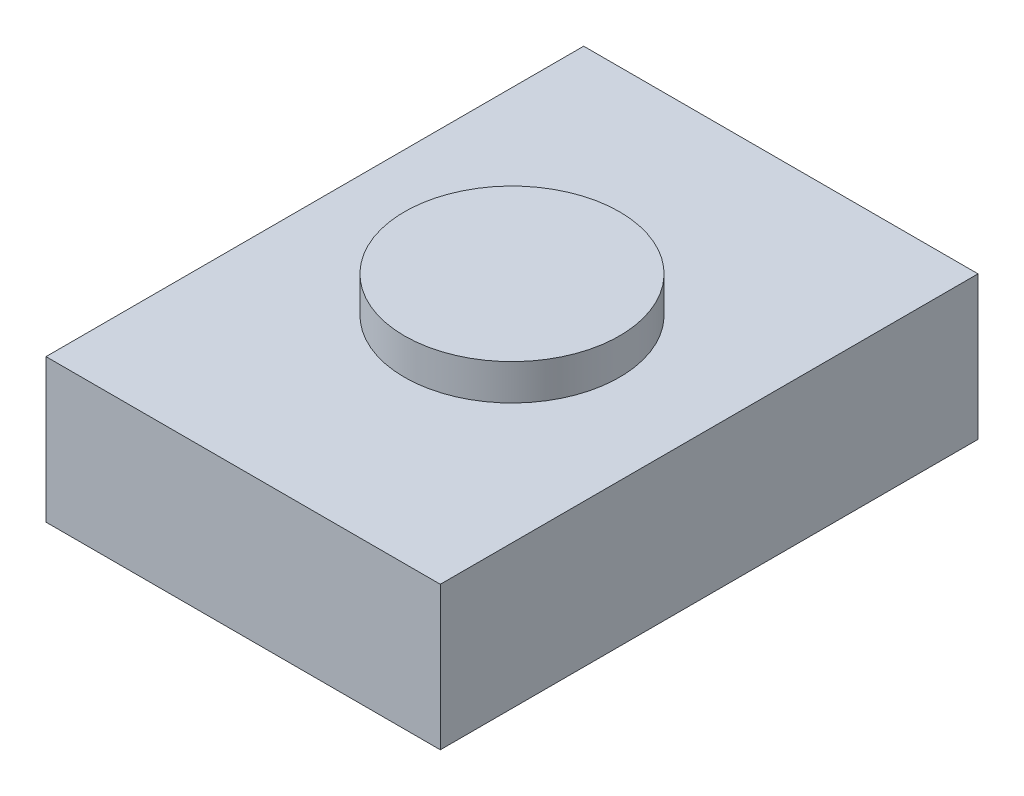
ISO-10303-21;
HEADER;
FILE_DESCRIPTION(('STEP AP214'),'2;1');
FILE_NAME('part.step','',(''),(''),'','','');
FILE_SCHEMA(('AUTOMOTIVE_DESIGN { 1 0 10303 214 1 1 1 1 }'));
ENDSEC;
DATA;
#1=APPLICATION_CONTEXT('core data for automotive mechanical design processes');
#2=APPLICATION_PROTOCOL_DEFINITION('international standard','automotive_design',2000,#1);
#3=PRODUCT_CONTEXT('',#1,'mechanical');
#4=PRODUCT('Part','Part','',(#3));
#5=PRODUCT_RELATED_PRODUCT_CATEGORY('part','',(#4));
#6=PRODUCT_DEFINITION_FORMATION('','',#4);
#7=PRODUCT_DEFINITION_CONTEXT('part definition',#1,'design');
#8=PRODUCT_DEFINITION('design','',#6,#7);
#9=PRODUCT_DEFINITION_SHAPE('','',#8);
#10=(LENGTH_UNIT() NAMED_UNIT(*) SI_UNIT(.MILLI.,.METRE.));
#11=(NAMED_UNIT(*) PLANE_ANGLE_UNIT() SI_UNIT($,.RADIAN.));
#12=(NAMED_UNIT(*) SI_UNIT($,.STERADIAN.) SOLID_ANGLE_UNIT());
#13=UNCERTAINTY_MEASURE_WITH_UNIT(LENGTH_MEASURE(1.E-05),#10,'distance_accuracy_value','');
#14=(GEOMETRIC_REPRESENTATION_CONTEXT(3) GLOBAL_UNCERTAINTY_ASSIGNED_CONTEXT((#13)) GLOBAL_UNIT_ASSIGNED_CONTEXT((#10,
#11,#12)) REPRESENTATION_CONTEXT('',''));
#15=CARTESIAN_POINT('',(0.,0.,0.));
#16=DIRECTION('',(0.,0.,1.));
#17=DIRECTION('',(1.,0.,0.));
#18=AXIS2_PLACEMENT_3D('',#15,#16,#17);
#19=CARTESIAN_POINT('',(1.397,1.016,-1.905));
#20=DIRECTION('',(-1.,0.,0.));
#21=DIRECTION('',(0.,0.,1.));
#22=AXIS2_PLACEMENT_3D('',#19,#20,#21);
#23=PLANE('',#22);
#24=DIRECTION('',(0.,0.,-1.));
#25=VECTOR('',#24,1.);
#26=CARTESIAN_POINT('',(1.397,0.,-1.905));
#27=LINE('',#26,#25);
#28=CARTESIAN_POINT('',(1.397,0.,1.905));
#29=VERTEX_POINT('',#28);
#30=CARTESIAN_POINT('',(1.397,0.,-1.905));
#31=VERTEX_POINT('',#30);
#32=EDGE_CURVE('E99',#29,#31,#27,.T.);
#33=ORIENTED_EDGE('',*,*,#32,.T.);
#34=DIRECTION('',(0.,-1.,0.));
#35=VECTOR('',#34,1.);
#36=CARTESIAN_POINT('',(1.397,1.016,-1.905));
#37=LINE('',#36,#35);
#38=CARTESIAN_POINT('',(1.397,1.016,-1.905));
#39=VERTEX_POINT('',#38);
#40=EDGE_CURVE('E36',#39,#31,#37,.T.);
#41=ORIENTED_EDGE('',*,*,#40,.F.);
#42=DIRECTION('',(0.,0.,-1.));
#43=VECTOR('',#42,1.);
#44=CARTESIAN_POINT('',(1.397,1.016,-1.905));
#45=LINE('',#44,#43);
#46=CARTESIAN_POINT('',(1.397,1.016,1.905));
#47=VERTEX_POINT('',#46);
#48=EDGE_CURVE('E86',#47,#39,#45,.T.);
#49=ORIENTED_EDGE('',*,*,#48,.F.);
#50=DIRECTION('',(0.,-1.,0.));
#51=VECTOR('',#50,1.);
#52=CARTESIAN_POINT('',(1.397,1.016,1.905));
#53=LINE('',#52,#51);
#54=EDGE_CURVE('E95',#47,#29,#53,.T.);
#55=ORIENTED_EDGE('',*,*,#54,.T.);
#56=EDGE_LOOP('',(#33,#41,#49,#55));
#57=FACE_BOUND('',#56,.T.);
#58=ADVANCED_FACE('F33',(#57),#23,.F.);
#59=CARTESIAN_POINT('',(-1.397,1.016,-1.905));
#60=DIRECTION('',(0.,0.,1.));
#61=DIRECTION('',(1.,0.,0.));
#62=AXIS2_PLACEMENT_3D('',#59,#60,#61);
#63=PLANE('',#62);
#64=DIRECTION('',(-1.,0.,0.));
#65=VECTOR('',#64,1.);
#66=CARTESIAN_POINT('',(-1.397,0.,-1.905));
#67=LINE('',#66,#65);
#68=CARTESIAN_POINT('',(-1.397,0.,-1.905));
#69=VERTEX_POINT('',#68);
#70=EDGE_CURVE('E91',#31,#69,#67,.T.);
#71=ORIENTED_EDGE('',*,*,#70,.T.);
#72=DIRECTION('',(0.,-1.,0.));
#73=VECTOR('',#72,1.);
#74=CARTESIAN_POINT('',(-1.397,1.016,-1.905));
#75=LINE('',#74,#73);
#76=CARTESIAN_POINT('',(-1.397,1.016,-1.905));
#77=VERTEX_POINT('',#76);
#78=EDGE_CURVE('E89',#77,#69,#75,.T.);
#79=ORIENTED_EDGE('',*,*,#78,.F.);
#80=DIRECTION('',(-1.,0.,0.));
#81=VECTOR('',#80,1.);
#82=CARTESIAN_POINT('',(-1.397,1.016,-1.905));
#83=LINE('',#82,#81);
#84=EDGE_CURVE('E81',#39,#77,#83,.T.);
#85=ORIENTED_EDGE('',*,*,#84,.F.);
#86=ORIENTED_EDGE('',*,*,#40,.T.);
#87=EDGE_LOOP('',(#71,#79,#85,#86));
#88=FACE_BOUND('',#87,.T.);
#89=ADVANCED_FACE('F90',(#88),#63,.F.);
#90=CARTESIAN_POINT('',(-1.397,1.016,-1.905));
#91=DIRECTION('',(1.,0.,0.));
#92=DIRECTION('',(0.,0.,-1.));
#93=AXIS2_PLACEMENT_3D('',#90,#91,#92);
#94=PLANE('',#93);
#95=DIRECTION('',(0.,0.,1.));
#96=VECTOR('',#95,1.);
#97=CARTESIAN_POINT('',(-1.397,0.,-1.905));
#98=LINE('',#97,#96);
#99=CARTESIAN_POINT('',(-1.397,0.,1.905));
#100=VERTEX_POINT('',#99);
#101=EDGE_CURVE('E67',#69,#100,#98,.T.);
#102=ORIENTED_EDGE('',*,*,#101,.T.);
#103=DIRECTION('',(0.,-1.,0.));
#104=VECTOR('',#103,1.);
#105=CARTESIAN_POINT('',(-1.397,1.016,1.905));
#106=LINE('',#105,#104);
#107=CARTESIAN_POINT('',(-1.397,1.016,1.905));
#108=VERTEX_POINT('',#107);
#109=EDGE_CURVE('E92',#108,#100,#106,.T.);
#110=ORIENTED_EDGE('',*,*,#109,.F.);
#111=DIRECTION('',(0.,0.,1.));
#112=VECTOR('',#111,1.);
#113=CARTESIAN_POINT('',(-1.397,1.016,-1.905));
#114=LINE('',#113,#112);
#115=EDGE_CURVE('E84',#77,#108,#114,.T.);
#116=ORIENTED_EDGE('',*,*,#115,.F.);
#117=ORIENTED_EDGE('',*,*,#78,.T.);
#118=EDGE_LOOP('',(#102,#110,#116,#117));
#119=FACE_BOUND('',#118,.T.);
#120=ADVANCED_FACE('F93',(#119),#94,.F.);
#121=CARTESIAN_POINT('',(-1.397,1.016,1.905));
#122=DIRECTION('',(0.,0.,-1.));
#123=DIRECTION('',(-1.,0.,0.));
#124=AXIS2_PLACEMENT_3D('',#121,#122,#123);
#125=PLANE('',#124);
#126=DIRECTION('',(1.,0.,0.));
#127=VECTOR('',#126,1.);
#128=CARTESIAN_POINT('',(-1.397,0.,1.905));
#129=LINE('',#128,#127);
#130=EDGE_CURVE('E73',#100,#29,#129,.T.);
#131=ORIENTED_EDGE('',*,*,#130,.T.);
#132=ORIENTED_EDGE('',*,*,#54,.F.);
#133=DIRECTION('',(1.,0.,0.));
#134=VECTOR('',#133,1.);
#135=CARTESIAN_POINT('',(-1.397,1.016,1.905));
#136=LINE('',#135,#134);
#137=EDGE_CURVE('E50',#108,#47,#136,.T.);
#138=ORIENTED_EDGE('',*,*,#137,.F.);
#139=ORIENTED_EDGE('',*,*,#109,.T.);
#140=EDGE_LOOP('',(#131,#132,#138,#139));
#141=FACE_BOUND('',#140,.T.);
#142=ADVANCED_FACE('F107',(#141),#125,.F.);
#143=CARTESIAN_POINT('',(0.,1.016,0.));
#144=DIRECTION('',(0.,1.,0.));
#145=DIRECTION('',(0.,0.,1.));
#146=AXIS2_PLACEMENT_3D('',#143,#144,#145);
#147=PLANE('',#146);
#148=CARTESIAN_POINT('',(0.,1.016,0.));
#149=DIRECTION('',(0.,1.,0.));
#150=DIRECTION('',(0.,0.,1.));
#151=AXIS2_PLACEMENT_3D('',#148,#149,#150);
#152=CIRCLE('',#151,0.762);
#153=CARTESIAN_POINT('',(0.,1.016,0.762));
#154=VERTEX_POINT('',#153);
#155=EDGE_CURVE('E11',#154,#154,#152,.T.);
#156=ORIENTED_EDGE('',*,*,#155,.F.);
#157=EDGE_LOOP('',(#156));
#158=FACE_BOUND('',#157,.T.);
#159=ORIENTED_EDGE('',*,*,#48,.T.);
#160=ORIENTED_EDGE('',*,*,#84,.T.);
#161=ORIENTED_EDGE('',*,*,#115,.T.);
#162=ORIENTED_EDGE('',*,*,#137,.T.);
#163=EDGE_LOOP('',(#159,#160,#161,#162));
#164=FACE_BOUND('',#163,.T.);
#165=ADVANCED_FACE('F82',(#158,#164),#147,.T.);
#166=CARTESIAN_POINT('',(0.,0.,0.));
#167=DIRECTION('',(0.,1.,0.));
#168=DIRECTION('',(0.,0.,1.));
#169=AXIS2_PLACEMENT_3D('',#166,#167,#168);
#170=PLANE('',#169);
#171=ORIENTED_EDGE('',*,*,#32,.F.);
#172=ORIENTED_EDGE('',*,*,#130,.F.);
#173=ORIENTED_EDGE('',*,*,#101,.F.);
#174=ORIENTED_EDGE('',*,*,#70,.F.);
#175=EDGE_LOOP('',(#171,#172,#173,#174));
#176=FACE_BOUND('',#175,.T.);
#177=ADVANCED_FACE('F110',(#176),#170,.F.);
#178=CARTESIAN_POINT('',(0.,1.27,0.));
#179=DIRECTION('',(0.,-1.,0.));
#180=DIRECTION('',(0.,0.,-1.));
#181=AXIS2_PLACEMENT_3D('',#178,#179,#180);
#182=CYLINDRICAL_SURFACE('',#181,0.762);
#183=CARTESIAN_POINT('',(0.,1.27,0.));
#184=DIRECTION('',(0.,1.,0.));
#185=DIRECTION('',(0.,0.,1.));
#186=AXIS2_PLACEMENT_3D('',#183,#184,#185);
#187=CIRCLE('',#186,0.762);
#188=CARTESIAN_POINT('',(0.,1.27,0.762));
#189=VERTEX_POINT('',#188);
#190=EDGE_CURVE('E102',#189,#189,#187,.T.);
#191=ORIENTED_EDGE('',*,*,#190,.F.);
#192=EDGE_LOOP('',(#191));
#193=FACE_BOUND('',#192,.T.);
#194=ORIENTED_EDGE('',*,*,#155,.T.);
#195=EDGE_LOOP('',(#194));
#196=FACE_BOUND('',#195,.T.);
#197=ADVANCED_FACE('F118',(#193,#196),#182,.T.);
#198=CARTESIAN_POINT('',(0.,1.27,0.));
#199=DIRECTION('',(0.,1.,0.));
#200=DIRECTION('',(0.,0.,1.));
#201=AXIS2_PLACEMENT_3D('',#198,#199,#200);
#202=PLANE('',#201);
#203=ORIENTED_EDGE('',*,*,#190,.T.);
#204=EDGE_LOOP('',(#203));
#205=FACE_BOUND('',#204,.T.);
#206=ADVANCED_FACE('F116',(#205),#202,.T.);
#207=CLOSED_SHELL('',(#58,#89,#120,#142,#165,#177,#197,#206));
#208=MANIFOLD_SOLID_BREP('B2',#207);
#209=ADVANCED_BREP_SHAPE_REPRESENTATION('',(#18,#208),#14);
#210=SHAPE_DEFINITION_REPRESENTATION(#9,#209);
ENDSEC;
END-ISO-10303-21;
